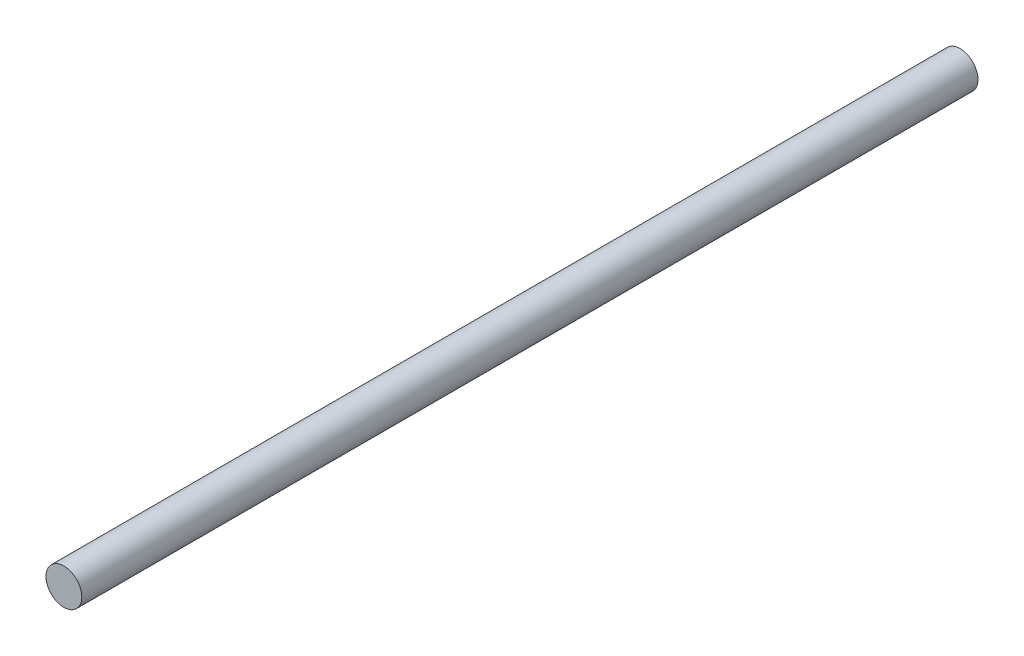
ISO-10303-21;
HEADER;
FILE_DESCRIPTION(('STEP AP214'),'2;1');
FILE_NAME('part.step','',(''),(''),'','','');
FILE_SCHEMA(('AUTOMOTIVE_DESIGN { 1 0 10303 214 1 1 1 1 }'));
ENDSEC;
DATA;
#1=APPLICATION_CONTEXT('core data for automotive mechanical design processes');
#2=APPLICATION_PROTOCOL_DEFINITION('international standard','automotive_design',2000,#1);
#3=PRODUCT_CONTEXT('',#1,'mechanical');
#4=PRODUCT('Part','Part','',(#3));
#5=PRODUCT_RELATED_PRODUCT_CATEGORY('part','',(#4));
#6=PRODUCT_DEFINITION_FORMATION('','',#4);
#7=PRODUCT_DEFINITION_CONTEXT('part definition',#1,'design');
#8=PRODUCT_DEFINITION('design','',#6,#7);
#9=PRODUCT_DEFINITION_SHAPE('','',#8);
#10=(LENGTH_UNIT() NAMED_UNIT(*) SI_UNIT(.MILLI.,.METRE.));
#11=(NAMED_UNIT(*) PLANE_ANGLE_UNIT() SI_UNIT($,.RADIAN.));
#12=(NAMED_UNIT(*) SI_UNIT($,.STERADIAN.) SOLID_ANGLE_UNIT());
#13=UNCERTAINTY_MEASURE_WITH_UNIT(LENGTH_MEASURE(1.E-05),#10,'distance_accuracy_value','');
#14=(GEOMETRIC_REPRESENTATION_CONTEXT(3) GLOBAL_UNCERTAINTY_ASSIGNED_CONTEXT((#13)) GLOBAL_UNIT_ASSIGNED_CONTEXT((#10,
#11,#12)) REPRESENTATION_CONTEXT('',''));
#15=CARTESIAN_POINT('',(0.,0.,0.));
#16=DIRECTION('',(0.,0.,1.));
#17=DIRECTION('',(1.,0.,0.));
#18=AXIS2_PLACEMENT_3D('',#15,#16,#17);
#19=CARTESIAN_POINT('',(0.,0.,100.));
#20=DIRECTION('',(0.,0.,-1.));
#21=DIRECTION('',(-1.,0.,0.));
#22=AXIS2_PLACEMENT_3D('',#19,#20,#21);
#23=CYLINDRICAL_SURFACE('',#22,2.);
#24=CARTESIAN_POINT('',(0.,0.,100.));
#25=DIRECTION('',(0.,0.,1.));
#26=DIRECTION('',(1.,0.,0.));
#27=AXIS2_PLACEMENT_3D('',#24,#25,#26);
#28=CIRCLE('',#27,2.);
#29=CARTESIAN_POINT('',(2.,0.,100.));
#30=VERTEX_POINT('',#29);
#31=EDGE_CURVE('E10',#30,#30,#28,.T.);
#32=ORIENTED_EDGE('',*,*,#31,.F.);
#33=EDGE_LOOP('',(#32));
#34=FACE_BOUND('',#33,.T.);
#35=CARTESIAN_POINT('',(0.,0.,0.));
#36=DIRECTION('',(0.,0.,1.));
#37=DIRECTION('',(1.,0.,0.));
#38=AXIS2_PLACEMENT_3D('',#35,#36,#37);
#39=CIRCLE('',#38,2.);
#40=CARTESIAN_POINT('',(2.,0.,0.));
#41=VERTEX_POINT('',#40);
#42=EDGE_CURVE('E42',#41,#41,#39,.T.);
#43=ORIENTED_EDGE('',*,*,#42,.T.);
#44=EDGE_LOOP('',(#43));
#45=FACE_BOUND('',#44,.T.);
#46=ADVANCED_FACE('F39',(#34,#45),#23,.T.);
#47=CARTESIAN_POINT('',(0.,0.,100.));
#48=DIRECTION('',(0.,0.,1.));
#49=DIRECTION('',(1.,0.,0.));
#50=AXIS2_PLACEMENT_3D('',#47,#48,#49);
#51=PLANE('',#50);
#52=ORIENTED_EDGE('',*,*,#31,.T.);
#53=EDGE_LOOP('',(#52));
#54=FACE_BOUND('',#53,.T.);
#55=ADVANCED_FACE('F56',(#54),#51,.T.);
#56=CARTESIAN_POINT('',(0.,0.,0.));
#57=DIRECTION('',(0.,0.,1.));
#58=DIRECTION('',(1.,0.,0.));
#59=AXIS2_PLACEMENT_3D('',#56,#57,#58);
#60=PLANE('',#59);
#61=ORIENTED_EDGE('',*,*,#42,.F.);
#62=EDGE_LOOP('',(#61));
#63=FACE_BOUND('',#62,.T.);
#64=ADVANCED_FACE('F54',(#63),#60,.F.);
#65=CLOSED_SHELL('',(#46,#55,#64));
#66=MANIFOLD_SOLID_BREP('B2',#65);
#67=ADVANCED_BREP_SHAPE_REPRESENTATION('',(#18,#66),#14);
#68=SHAPE_DEFINITION_REPRESENTATION(#9,#67);
ENDSEC;
END-ISO-10303-21;
